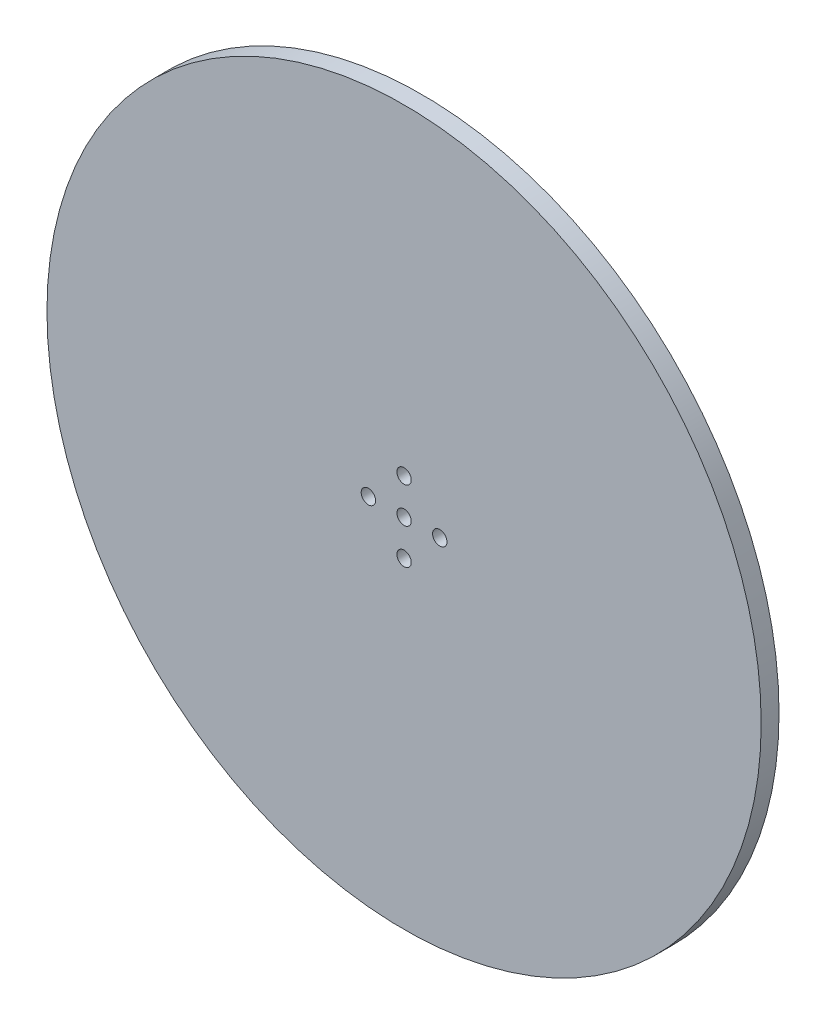
ISO-10303-21;
HEADER;
FILE_DESCRIPTION(('STEP AP214'),'2;1');
FILE_NAME('part.step','',(''),(''),'','','');
FILE_SCHEMA(('AUTOMOTIVE_DESIGN { 1 0 10303 214 1 1 1 1 }'));
ENDSEC;
DATA;
#1=APPLICATION_CONTEXT('core data for automotive mechanical design processes');
#2=APPLICATION_PROTOCOL_DEFINITION('international standard','automotive_design',2000,#1);
#3=PRODUCT_CONTEXT('',#1,'mechanical');
#4=PRODUCT('Part','Part','',(#3));
#5=PRODUCT_RELATED_PRODUCT_CATEGORY('part','',(#4));
#6=PRODUCT_DEFINITION_FORMATION('','',#4);
#7=PRODUCT_DEFINITION_CONTEXT('part definition',#1,'design');
#8=PRODUCT_DEFINITION('design','',#6,#7);
#9=PRODUCT_DEFINITION_SHAPE('','',#8);
#10=(LENGTH_UNIT() NAMED_UNIT(*) SI_UNIT(.MILLI.,.METRE.));
#11=(NAMED_UNIT(*) PLANE_ANGLE_UNIT() SI_UNIT($,.RADIAN.));
#12=(NAMED_UNIT(*) SI_UNIT($,.STERADIAN.) SOLID_ANGLE_UNIT());
#13=UNCERTAINTY_MEASURE_WITH_UNIT(LENGTH_MEASURE(1.E-05),#10,'distance_accuracy_value','');
#14=(GEOMETRIC_REPRESENTATION_CONTEXT(3) GLOBAL_UNCERTAINTY_ASSIGNED_CONTEXT((#13)) GLOBAL_UNIT_ASSIGNED_CONTEXT((#10,
#11,#12)) REPRESENTATION_CONTEXT('',''));
#15=CARTESIAN_POINT('',(0.,0.,0.));
#16=DIRECTION('',(0.,0.,1.));
#17=DIRECTION('',(1.,0.,0.));
#18=AXIS2_PLACEMENT_3D('',#15,#16,#17);
#19=CARTESIAN_POINT('',(0.,0.,6.35));
#20=DIRECTION('',(0.,0.,-1.));
#21=DIRECTION('',(-1.,0.,0.));
#22=AXIS2_PLACEMENT_3D('',#19,#20,#21);
#23=CYLINDRICAL_SURFACE('',#22,127.);
#24=CARTESIAN_POINT('',(0.,0.,6.35));
#25=DIRECTION('',(0.,0.,1.));
#26=DIRECTION('',(1.,0.,0.));
#27=AXIS2_PLACEMENT_3D('',#24,#25,#26);
#28=CIRCLE('',#27,127.);
#29=CARTESIAN_POINT('',(127.,0.,6.35));
#30=VERTEX_POINT('',#29);
#31=EDGE_CURVE('E10',#30,#30,#28,.T.);
#32=ORIENTED_EDGE('',*,*,#31,.F.);
#33=EDGE_LOOP('',(#32));
#34=FACE_BOUND('',#33,.T.);
#35=CARTESIAN_POINT('',(0.,0.,0.));
#36=DIRECTION('',(0.,0.,1.));
#37=DIRECTION('',(1.,0.,0.));
#38=AXIS2_PLACEMENT_3D('',#35,#36,#37);
#39=CIRCLE('',#38,127.);
#40=CARTESIAN_POINT('',(127.,0.,0.));
#41=VERTEX_POINT('',#40);
#42=EDGE_CURVE('E40',#41,#41,#39,.T.);
#43=ORIENTED_EDGE('',*,*,#42,.T.);
#44=EDGE_LOOP('',(#43));
#45=FACE_BOUND('',#44,.T.);
#46=ADVANCED_FACE('F33',(#34,#45),#23,.T.);
#47=CARTESIAN_POINT('',(0.,0.,6.35));
#48=DIRECTION('',(0.,0.,1.));
#49=DIRECTION('',(1.,0.,0.));
#50=AXIS2_PLACEMENT_3D('',#47,#48,#49);
#51=PLANE('',#50);
#52=CARTESIAN_POINT('',(12.7,1.33025439009923E-13,6.35));
#53=DIRECTION('',(0.,0.,1.));
#54=DIRECTION('',(1.,0.,0.));
#55=AXIS2_PLACEMENT_3D('',#52,#53,#54);
#56=CIRCLE('',#55,2.55269999999999);
#57=CARTESIAN_POINT('',(15.2527,1.33025439009923E-13,6.35));
#58=VERTEX_POINT('',#57);
#59=EDGE_CURVE('E112',#58,#58,#56,.T.);
#60=ORIENTED_EDGE('',*,*,#59,.F.);
#61=EDGE_LOOP('',(#60));
#62=FACE_BOUND('',#61,.T.);
#63=CARTESIAN_POINT('',(0.,-12.7,6.35));
#64=DIRECTION('',(0.,0.,1.));
#65=DIRECTION('',(1.,0.,0.));
#66=AXIS2_PLACEMENT_3D('',#63,#64,#65);
#67=CIRCLE('',#66,2.55269999999999);
#68=CARTESIAN_POINT('',(2.55269999999999,-12.7,6.35));
#69=VERTEX_POINT('',#68);
#70=EDGE_CURVE('E66',#69,#69,#67,.T.);
#71=ORIENTED_EDGE('',*,*,#70,.F.);
#72=EDGE_LOOP('',(#71));
#73=FACE_BOUND('',#72,.T.);
#74=CARTESIAN_POINT('',(-12.7,0.,6.35));
#75=DIRECTION('',(0.,0.,1.));
#76=DIRECTION('',(1.,0.,0.));
#77=AXIS2_PLACEMENT_3D('',#74,#75,#76);
#78=CIRCLE('',#77,2.55269999999999);
#79=CARTESIAN_POINT('',(-10.1473,0.,6.35));
#80=VERTEX_POINT('',#79);
#81=EDGE_CURVE('E56',#80,#80,#78,.T.);
#82=ORIENTED_EDGE('',*,*,#81,.F.);
#83=EDGE_LOOP('',(#82));
#84=FACE_BOUND('',#83,.T.);
#85=CARTESIAN_POINT('',(0.,12.7,6.35));
#86=DIRECTION('',(0.,0.,1.));
#87=DIRECTION('',(1.,0.,0.));
#88=AXIS2_PLACEMENT_3D('',#85,#86,#87);
#89=CIRCLE('',#88,2.55269999999999);
#90=CARTESIAN_POINT('',(2.55269999999999,12.7,6.35));
#91=VERTEX_POINT('',#90);
#92=EDGE_CURVE('E53',#91,#91,#89,.T.);
#93=ORIENTED_EDGE('',*,*,#92,.F.);
#94=EDGE_LOOP('',(#93));
#95=FACE_BOUND('',#94,.T.);
#96=CARTESIAN_POINT('',(0.,0.,6.35));
#97=DIRECTION('',(0.,0.,1.));
#98=DIRECTION('',(1.,0.,0.));
#99=AXIS2_PLACEMENT_3D('',#96,#97,#98);
#100=CIRCLE('',#99,2.54);
#101=CARTESIAN_POINT('',(2.54,0.,6.35));
#102=VERTEX_POINT('',#101);
#103=EDGE_CURVE('E48',#102,#102,#100,.T.);
#104=ORIENTED_EDGE('',*,*,#103,.F.);
#105=EDGE_LOOP('',(#104));
#106=FACE_BOUND('',#105,.T.);
#107=ORIENTED_EDGE('',*,*,#31,.T.);
#108=EDGE_LOOP('',(#107));
#109=FACE_BOUND('',#108,.T.);
#110=ADVANCED_FACE('F77',(#62,#73,#84,#95,#106,#109),#51,.T.);
#111=CARTESIAN_POINT('',(0.,0.,0.));
#112=DIRECTION('',(0.,0.,1.));
#113=DIRECTION('',(1.,0.,0.));
#114=AXIS2_PLACEMENT_3D('',#111,#112,#113);
#115=PLANE('',#114);
#116=CARTESIAN_POINT('',(12.7,1.33025439009923E-13,0.));
#117=DIRECTION('',(0.,0.,1.));
#118=DIRECTION('',(1.,0.,0.));
#119=AXIS2_PLACEMENT_3D('',#116,#117,#118);
#120=CIRCLE('',#119,2.55269999999999);
#121=CARTESIAN_POINT('',(15.2527,1.33025439009923E-13,0.));
#122=VERTEX_POINT('',#121);
#123=EDGE_CURVE('E115',#122,#122,#120,.T.);
#124=ORIENTED_EDGE('',*,*,#123,.T.);
#125=EDGE_LOOP('',(#124));
#126=FACE_BOUND('',#125,.T.);
#127=CARTESIAN_POINT('',(0.,-12.7,0.));
#128=DIRECTION('',(0.,0.,1.));
#129=DIRECTION('',(1.,0.,0.));
#130=AXIS2_PLACEMENT_3D('',#127,#128,#129);
#131=CIRCLE('',#130,2.55269999999999);
#132=CARTESIAN_POINT('',(2.55269999999999,-12.7,0.));
#133=VERTEX_POINT('',#132);
#134=EDGE_CURVE('E36',#133,#133,#131,.T.);
#135=ORIENTED_EDGE('',*,*,#134,.T.);
#136=EDGE_LOOP('',(#135));
#137=FACE_BOUND('',#136,.T.);
#138=CARTESIAN_POINT('',(-12.7,0.,0.));
#139=DIRECTION('',(0.,0.,1.));
#140=DIRECTION('',(1.,0.,0.));
#141=AXIS2_PLACEMENT_3D('',#138,#139,#140);
#142=CIRCLE('',#141,2.55269999999999);
#143=CARTESIAN_POINT('',(-10.1473,0.,0.));
#144=VERTEX_POINT('',#143);
#145=EDGE_CURVE('E54',#144,#144,#142,.T.);
#146=ORIENTED_EDGE('',*,*,#145,.T.);
#147=EDGE_LOOP('',(#146));
#148=FACE_BOUND('',#147,.T.);
#149=CARTESIAN_POINT('',(0.,12.7,0.));
#150=DIRECTION('',(0.,0.,1.));
#151=DIRECTION('',(1.,0.,0.));
#152=AXIS2_PLACEMENT_3D('',#149,#150,#151);
#153=CIRCLE('',#152,2.55269999999999);
#154=CARTESIAN_POINT('',(2.55269999999999,12.7,0.));
#155=VERTEX_POINT('',#154);
#156=EDGE_CURVE('E51',#155,#155,#153,.T.);
#157=ORIENTED_EDGE('',*,*,#156,.T.);
#158=EDGE_LOOP('',(#157));
#159=FACE_BOUND('',#158,.T.);
#160=CARTESIAN_POINT('',(0.,0.,0.));
#161=DIRECTION('',(0.,0.,1.));
#162=DIRECTION('',(1.,0.,0.));
#163=AXIS2_PLACEMENT_3D('',#160,#161,#162);
#164=CIRCLE('',#163,2.54);
#165=CARTESIAN_POINT('',(2.54,0.,0.));
#166=VERTEX_POINT('',#165);
#167=EDGE_CURVE('E45',#166,#166,#164,.T.);
#168=ORIENTED_EDGE('',*,*,#167,.T.);
#169=EDGE_LOOP('',(#168));
#170=FACE_BOUND('',#169,.T.);
#171=ORIENTED_EDGE('',*,*,#42,.F.);
#172=EDGE_LOOP('',(#171));
#173=FACE_BOUND('',#172,.T.);
#174=ADVANCED_FACE('F79',(#126,#137,#148,#159,#170,#173),#115,.F.);
#175=CARTESIAN_POINT('',(0.,0.,0.));
#176=DIRECTION('',(0.,0.,1.));
#177=DIRECTION('',(1.,0.,0.));
#178=AXIS2_PLACEMENT_3D('',#175,#176,#177);
#179=CYLINDRICAL_SURFACE('',#178,2.54);
#180=ORIENTED_EDGE('',*,*,#167,.F.);
#181=EDGE_LOOP('',(#180));
#182=FACE_BOUND('',#181,.T.);
#183=ORIENTED_EDGE('',*,*,#103,.T.);
#184=EDGE_LOOP('',(#183));
#185=FACE_BOUND('',#184,.T.);
#186=ADVANCED_FACE('F75',(#182,#185),#179,.F.);
#187=CARTESIAN_POINT('',(0.,12.7,6.35));
#188=DIRECTION('',(0.,0.,1.));
#189=DIRECTION('',(1.,0.,0.));
#190=AXIS2_PLACEMENT_3D('',#187,#188,#189);
#191=CYLINDRICAL_SURFACE('',#190,2.55269999999999);
#192=ORIENTED_EDGE('',*,*,#92,.T.);
#193=EDGE_LOOP('',(#192));
#194=FACE_BOUND('',#193,.T.);
#195=ORIENTED_EDGE('',*,*,#156,.F.);
#196=EDGE_LOOP('',(#195));
#197=FACE_BOUND('',#196,.T.);
#198=ADVANCED_FACE('F93',(#194,#197),#191,.F.);
#199=CARTESIAN_POINT('',(-12.7,0.,6.35));
#200=DIRECTION('',(0.,0.,1.));
#201=DIRECTION('',(1.,0.,0.));
#202=AXIS2_PLACEMENT_3D('',#199,#200,#201);
#203=CYLINDRICAL_SURFACE('',#202,2.55269999999999);
#204=ORIENTED_EDGE('',*,*,#81,.T.);
#205=EDGE_LOOP('',(#204));
#206=FACE_BOUND('',#205,.T.);
#207=ORIENTED_EDGE('',*,*,#145,.F.);
#208=EDGE_LOOP('',(#207));
#209=FACE_BOUND('',#208,.T.);
#210=ADVANCED_FACE('F97',(#206,#209),#203,.F.);
#211=CARTESIAN_POINT('',(0.,-12.7,6.35));
#212=DIRECTION('',(0.,0.,1.));
#213=DIRECTION('',(1.,0.,0.));
#214=AXIS2_PLACEMENT_3D('',#211,#212,#213);
#215=CYLINDRICAL_SURFACE('',#214,2.55269999999999);
#216=ORIENTED_EDGE('',*,*,#70,.T.);
#217=EDGE_LOOP('',(#216));
#218=FACE_BOUND('',#217,.T.);
#219=ORIENTED_EDGE('',*,*,#134,.F.);
#220=EDGE_LOOP('',(#219));
#221=FACE_BOUND('',#220,.T.);
#222=ADVANCED_FACE('F101',(#218,#221),#215,.F.);
#223=CARTESIAN_POINT('',(12.7,1.33025439009923E-13,6.35));
#224=DIRECTION('',(0.,0.,1.));
#225=DIRECTION('',(1.,0.,0.));
#226=AXIS2_PLACEMENT_3D('',#223,#224,#225);
#227=CYLINDRICAL_SURFACE('',#226,2.55269999999999);
#228=ORIENTED_EDGE('',*,*,#59,.T.);
#229=EDGE_LOOP('',(#228));
#230=FACE_BOUND('',#229,.T.);
#231=ORIENTED_EDGE('',*,*,#123,.F.);
#232=EDGE_LOOP('',(#231));
#233=FACE_BOUND('',#232,.T.);
#234=ADVANCED_FACE('F104',(#230,#233),#227,.F.);
#235=CLOSED_SHELL('',(#46,#110,#174,#186,#198,#210,#222,#234));
#236=MANIFOLD_SOLID_BREP('B2',#235);
#237=ADVANCED_BREP_SHAPE_REPRESENTATION('',(#18,#236),#14);
#238=SHAPE_DEFINITION_REPRESENTATION(#9,#237);
ENDSEC;
END-ISO-10303-21;
